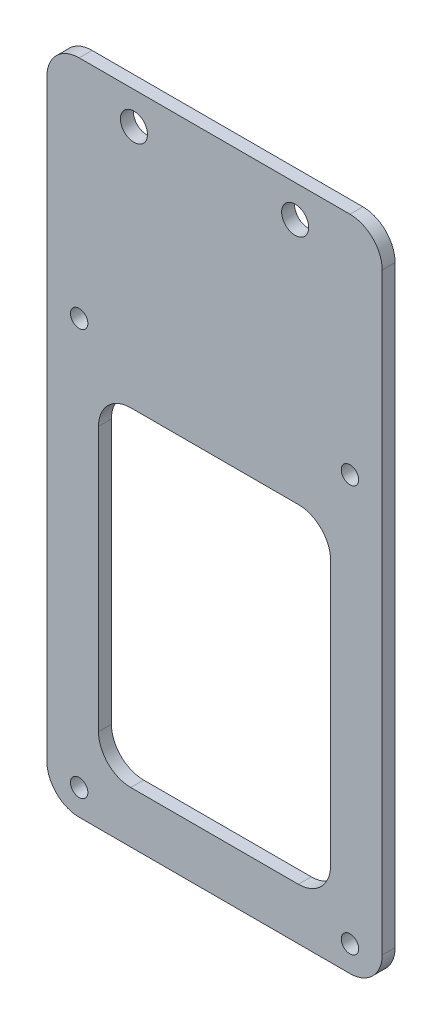
ISO-10303-21;
HEADER;
FILE_DESCRIPTION(('STEP AP214'),'2;1');
FILE_NAME('part.step','',(''),(''),'','','');
FILE_SCHEMA(('AUTOMOTIVE_DESIGN { 1 0 10303 214 1 1 1 1 }'));
ENDSEC;
DATA;
#1=APPLICATION_CONTEXT('core data for automotive mechanical design processes');
#2=APPLICATION_PROTOCOL_DEFINITION('international standard','automotive_design',2000,#1);
#3=PRODUCT_CONTEXT('',#1,'mechanical');
#4=PRODUCT('Part','Part','',(#3));
#5=PRODUCT_RELATED_PRODUCT_CATEGORY('part','',(#4));
#6=PRODUCT_DEFINITION_FORMATION('','',#4);
#7=PRODUCT_DEFINITION_CONTEXT('part definition',#1,'design');
#8=PRODUCT_DEFINITION('design','',#6,#7);
#9=PRODUCT_DEFINITION_SHAPE('','',#8);
#10=(LENGTH_UNIT() NAMED_UNIT(*) SI_UNIT(.MILLI.,.METRE.));
#11=(NAMED_UNIT(*) PLANE_ANGLE_UNIT() SI_UNIT($,.RADIAN.));
#12=(NAMED_UNIT(*) SI_UNIT($,.STERADIAN.) SOLID_ANGLE_UNIT());
#13=UNCERTAINTY_MEASURE_WITH_UNIT(LENGTH_MEASURE(1.E-05),#10,'distance_accuracy_value','');
#14=(GEOMETRIC_REPRESENTATION_CONTEXT(3) GLOBAL_UNCERTAINTY_ASSIGNED_CONTEXT((#13)) GLOBAL_UNIT_ASSIGNED_CONTEXT((#10,
#11,#12)) REPRESENTATION_CONTEXT('',''));
#15=CARTESIAN_POINT('',(0.,0.,0.));
#16=DIRECTION('',(0.,0.,1.));
#17=DIRECTION('',(1.,0.,0.));
#18=AXIS2_PLACEMENT_3D('',#15,#16,#17);
#19=CARTESIAN_POINT('',(26.,-51.,2.));
#20=DIRECTION('',(-1.,0.,0.));
#21=DIRECTION('',(0.,0.,1.));
#22=AXIS2_PLACEMENT_3D('',#19,#20,#21);
#23=PLANE('',#22);
#24=DIRECTION('',(0.,1.,0.));
#25=VECTOR('',#24,1.);
#26=CARTESIAN_POINT('',(26.,-51.,2.));
#27=LINE('',#26,#25);
#28=CARTESIAN_POINT('',(26.,-46.,2.));
#29=VERTEX_POINT('',#28);
#30=CARTESIAN_POINT('',(26.,46.,2.));
#31=VERTEX_POINT('',#30);
#32=EDGE_CURVE('E173',#29,#31,#27,.T.);
#33=ORIENTED_EDGE('',*,*,#32,.F.);
#34=DIRECTION('',(0.,0.,-1.));
#35=VECTOR('',#34,1.);
#36=CARTESIAN_POINT('',(26.,-46.,2.));
#37=LINE('',#36,#35);
#38=CARTESIAN_POINT('',(26.,-46.,0.));
#39=VERTEX_POINT('',#38);
#40=EDGE_CURVE('E201',#29,#39,#37,.T.);
#41=ORIENTED_EDGE('',*,*,#40,.T.);
#42=DIRECTION('',(0.,1.,0.));
#43=VECTOR('',#42,1.);
#44=CARTESIAN_POINT('',(26.,-51.,0.));
#45=LINE('',#44,#43);
#46=CARTESIAN_POINT('',(26.,46.,0.));
#47=VERTEX_POINT('',#46);
#48=EDGE_CURVE('E330',#39,#47,#45,.T.);
#49=ORIENTED_EDGE('',*,*,#48,.T.);
#50=DIRECTION('',(0.,0.,-1.));
#51=VECTOR('',#50,1.);
#52=CARTESIAN_POINT('',(26.,46.,2.));
#53=LINE('',#52,#51);
#54=EDGE_CURVE('E199',#47,#31,#53,.F.);
#55=ORIENTED_EDGE('',*,*,#54,.T.);
#56=EDGE_LOOP('',(#33,#41,#49,#55));
#57=FACE_BOUND('',#56,.T.);
#58=ADVANCED_FACE('F34',(#57),#23,.F.);
#59=CARTESIAN_POINT('',(-26.,51.,2.));
#60=DIRECTION('',(0.,-1.,0.));
#61=DIRECTION('',(0.,0.,-1.));
#62=AXIS2_PLACEMENT_3D('',#59,#60,#61);
#63=PLANE('',#62);
#64=DIRECTION('',(-1.,0.,0.));
#65=VECTOR('',#64,1.);
#66=CARTESIAN_POINT('',(-26.,51.,0.));
#67=LINE('',#66,#65);
#68=CARTESIAN_POINT('',(21.,51.,0.));
#69=VERTEX_POINT('',#68);
#70=CARTESIAN_POINT('',(-21.,51.,0.));
#71=VERTEX_POINT('',#70);
#72=EDGE_CURVE('E179',#69,#71,#67,.T.);
#73=ORIENTED_EDGE('',*,*,#72,.T.);
#74=DIRECTION('',(0.,0.,-1.));
#75=VECTOR('',#74,1.);
#76=CARTESIAN_POINT('',(-21.,51.,2.));
#77=LINE('',#76,#75);
#78=CARTESIAN_POINT('',(-21.,51.,2.));
#79=VERTEX_POINT('',#78);
#80=EDGE_CURVE('E207',#71,#79,#77,.F.);
#81=ORIENTED_EDGE('',*,*,#80,.T.);
#82=DIRECTION('',(-1.,0.,0.));
#83=VECTOR('',#82,1.);
#84=CARTESIAN_POINT('',(-26.,51.,2.));
#85=LINE('',#84,#83);
#86=CARTESIAN_POINT('',(21.,51.,2.));
#87=VERTEX_POINT('',#86);
#88=EDGE_CURVE('E177',#87,#79,#85,.T.);
#89=ORIENTED_EDGE('',*,*,#88,.F.);
#90=DIRECTION('',(0.,0.,-1.));
#91=VECTOR('',#90,1.);
#92=CARTESIAN_POINT('',(21.,51.,2.));
#93=LINE('',#92,#91);
#94=EDGE_CURVE('E204',#87,#69,#93,.T.);
#95=ORIENTED_EDGE('',*,*,#94,.T.);
#96=EDGE_LOOP('',(#73,#81,#89,#95));
#97=FACE_BOUND('',#96,.T.);
#98=ADVANCED_FACE('F344',(#97),#63,.F.);
#99=CARTESIAN_POINT('',(-26.,-51.,2.));
#100=DIRECTION('',(1.,0.,0.));
#101=DIRECTION('',(0.,0.,-1.));
#102=AXIS2_PLACEMENT_3D('',#99,#100,#101);
#103=PLANE('',#102);
#104=DIRECTION('',(0.,-1.,0.));
#105=VECTOR('',#104,1.);
#106=CARTESIAN_POINT('',(-26.,-51.,0.));
#107=LINE('',#106,#105);
#108=CARTESIAN_POINT('',(-26.,46.,0.));
#109=VERTEX_POINT('',#108);
#110=CARTESIAN_POINT('',(-26.,-46.,0.));
#111=VERTEX_POINT('',#110);
#112=EDGE_CURVE('E174',#109,#111,#107,.T.);
#113=ORIENTED_EDGE('',*,*,#112,.T.);
#114=DIRECTION('',(0.,0.,-1.));
#115=VECTOR('',#114,1.);
#116=CARTESIAN_POINT('',(-26.,-46.,2.));
#117=LINE('',#116,#115);
#118=CARTESIAN_POINT('',(-26.,-46.,2.));
#119=VERTEX_POINT('',#118);
#120=EDGE_CURVE('E152',#111,#119,#117,.F.);
#121=ORIENTED_EDGE('',*,*,#120,.T.);
#122=DIRECTION('',(0.,-1.,0.));
#123=VECTOR('',#122,1.);
#124=CARTESIAN_POINT('',(-26.,-51.,2.));
#125=LINE('',#124,#123);
#126=CARTESIAN_POINT('',(-26.,46.,2.));
#127=VERTEX_POINT('',#126);
#128=EDGE_CURVE('E335',#127,#119,#125,.T.);
#129=ORIENTED_EDGE('',*,*,#128,.F.);
#130=DIRECTION('',(0.,0.,-1.));
#131=VECTOR('',#130,1.);
#132=CARTESIAN_POINT('',(-26.,46.,2.));
#133=LINE('',#132,#131);
#134=EDGE_CURVE('E157',#127,#109,#133,.T.);
#135=ORIENTED_EDGE('',*,*,#134,.T.);
#136=EDGE_LOOP('',(#113,#121,#129,#135));
#137=FACE_BOUND('',#136,.T.);
#138=ADVANCED_FACE('F354',(#137),#103,.F.);
#139=CARTESIAN_POINT('',(-26.,-51.,2.));
#140=DIRECTION('',(0.,1.,0.));
#141=DIRECTION('',(0.,0.,1.));
#142=AXIS2_PLACEMENT_3D('',#139,#140,#141);
#143=PLANE('',#142);
#144=DIRECTION('',(1.,0.,0.));
#145=VECTOR('',#144,1.);
#146=CARTESIAN_POINT('',(-26.,-51.,2.));
#147=LINE('',#146,#145);
#148=CARTESIAN_POINT('',(-21.,-51.,2.));
#149=VERTEX_POINT('',#148);
#150=CARTESIAN_POINT('',(21.,-51.,2.));
#151=VERTEX_POINT('',#150);
#152=EDGE_CURVE('E167',#149,#151,#147,.T.);
#153=ORIENTED_EDGE('',*,*,#152,.F.);
#154=DIRECTION('',(0.,0.,-1.));
#155=VECTOR('',#154,1.);
#156=CARTESIAN_POINT('',(-21.,-51.,2.));
#157=LINE('',#156,#155);
#158=CARTESIAN_POINT('',(-21.,-51.,0.));
#159=VERTEX_POINT('',#158);
#160=EDGE_CURVE('E151',#149,#159,#157,.T.);
#161=ORIENTED_EDGE('',*,*,#160,.T.);
#162=DIRECTION('',(1.,0.,0.));
#163=VECTOR('',#162,1.);
#164=CARTESIAN_POINT('',(-26.,-51.,0.));
#165=LINE('',#164,#163);
#166=CARTESIAN_POINT('',(21.,-51.,0.));
#167=VERTEX_POINT('',#166);
#168=EDGE_CURVE('E164',#159,#167,#165,.T.);
#169=ORIENTED_EDGE('',*,*,#168,.T.);
#170=DIRECTION('',(0.,0.,-1.));
#171=VECTOR('',#170,1.);
#172=CARTESIAN_POINT('',(21.,-51.,2.));
#173=LINE('',#172,#171);
#174=EDGE_CURVE('E169',#167,#151,#173,.F.);
#175=ORIENTED_EDGE('',*,*,#174,.T.);
#176=EDGE_LOOP('',(#153,#161,#169,#175));
#177=FACE_BOUND('',#176,.T.);
#178=ADVANCED_FACE('F163',(#177),#143,.F.);
#179=CARTESIAN_POINT('',(0.,0.,2.));
#180=DIRECTION('',(0.,0.,-1.));
#181=DIRECTION('',(-1.,0.,0.));
#182=AXIS2_PLACEMENT_3D('',#179,#180,#181);
#183=PLANE('',#182);
#184=DIRECTION('',(-1.,0.,0.));
#185=VECTOR('',#184,1.);
#186=CARTESIAN_POINT('',(-18.,8.,2.));
#187=LINE('',#186,#185);
#188=CARTESIAN_POINT('',(13.,8.,2.));
#189=VERTEX_POINT('',#188);
#190=CARTESIAN_POINT('',(-13.,8.,2.));
#191=VERTEX_POINT('',#190);
#192=EDGE_CURVE('E255',#189,#191,#187,.T.);
#193=ORIENTED_EDGE('',*,*,#192,.F.);
#194=CARTESIAN_POINT('',(13.,3.,2.));
#195=DIRECTION('',(0.,0.,-1.));
#196=DIRECTION('',(-1.,0.,0.));
#197=AXIS2_PLACEMENT_3D('',#194,#195,#196);
#198=CIRCLE('',#197,5.);
#199=CARTESIAN_POINT('',(18.,3.,2.));
#200=VERTEX_POINT('',#199);
#201=EDGE_CURVE('E42',#189,#200,#198,.T.);
#202=ORIENTED_EDGE('',*,*,#201,.T.);
#203=DIRECTION('',(0.,1.,0.));
#204=VECTOR('',#203,1.);
#205=CARTESIAN_POINT('',(18.,8.,2.));
#206=LINE('',#205,#204);
#207=CARTESIAN_POINT('',(18.,-38.,2.));
#208=VERTEX_POINT('',#207);
#209=EDGE_CURVE('E254',#208,#200,#206,.T.);
#210=ORIENTED_EDGE('',*,*,#209,.F.);
#211=CARTESIAN_POINT('',(13.,-38.,2.));
#212=DIRECTION('',(0.,0.,-1.));
#213=DIRECTION('',(-1.,0.,0.));
#214=AXIS2_PLACEMENT_3D('',#211,#212,#213);
#215=CIRCLE('',#214,5.);
#216=CARTESIAN_POINT('',(13.,-43.,2.));
#217=VERTEX_POINT('',#216);
#218=EDGE_CURVE('E240',#208,#217,#215,.T.);
#219=ORIENTED_EDGE('',*,*,#218,.T.);
#220=DIRECTION('',(1.,0.,0.));
#221=VECTOR('',#220,1.);
#222=CARTESIAN_POINT('',(-18.,-43.,2.));
#223=LINE('',#222,#221);
#224=CARTESIAN_POINT('',(-13.,-43.,2.));
#225=VERTEX_POINT('',#224);
#226=EDGE_CURVE('E289',#225,#217,#223,.T.);
#227=ORIENTED_EDGE('',*,*,#226,.F.);
#228=CARTESIAN_POINT('',(-13.,-38.,2.));
#229=DIRECTION('',(0.,0.,-1.));
#230=DIRECTION('',(-1.,0.,0.));
#231=AXIS2_PLACEMENT_3D('',#228,#229,#230);
#232=CIRCLE('',#231,5.);
#233=CARTESIAN_POINT('',(-18.,-38.,2.));
#234=VERTEX_POINT('',#233);
#235=EDGE_CURVE('E244',#225,#234,#232,.T.);
#236=ORIENTED_EDGE('',*,*,#235,.T.);
#237=DIRECTION('',(0.,-1.,0.));
#238=VECTOR('',#237,1.);
#239=CARTESIAN_POINT('',(-18.,8.,2.));
#240=LINE('',#239,#238);
#241=CARTESIAN_POINT('',(-18.,3.,2.));
#242=VERTEX_POINT('',#241);
#243=EDGE_CURVE('E278',#242,#234,#240,.T.);
#244=ORIENTED_EDGE('',*,*,#243,.F.);
#245=CARTESIAN_POINT('',(-13.,3.,2.));
#246=DIRECTION('',(0.,0.,-1.));
#247=DIRECTION('',(-1.,0.,0.));
#248=AXIS2_PLACEMENT_3D('',#245,#246,#247);
#249=CIRCLE('',#248,5.);
#250=EDGE_CURVE('E49',#242,#191,#249,.T.);
#251=ORIENTED_EDGE('',*,*,#250,.T.);
#252=EDGE_LOOP('',(#193,#202,#210,#219,#227,#236,#244,#251));
#253=FACE_BOUND('',#252,.T.);
#254=CARTESIAN_POINT('',(-21.,-47.,2.));
#255=DIRECTION('',(0.,0.,1.));
#256=DIRECTION('',(1.,0.,0.));
#257=AXIS2_PLACEMENT_3D('',#254,#255,#256);
#258=CIRCLE('',#257,1.35);
#259=CARTESIAN_POINT('',(-19.65,-47.,2.));
#260=VERTEX_POINT('',#259);
#261=EDGE_CURVE('E301',#260,#260,#258,.T.);
#262=ORIENTED_EDGE('',*,*,#261,.F.);
#263=EDGE_LOOP('',(#262));
#264=FACE_BOUND('',#263,.T.);
#265=CARTESIAN_POINT('',(21.,16.,2.));
#266=DIRECTION('',(0.,0.,1.));
#267=DIRECTION('',(-1.,0.,0.));
#268=AXIS2_PLACEMENT_3D('',#265,#266,#267);
#269=CIRCLE('',#268,1.35);
#270=CARTESIAN_POINT('',(19.65,16.,2.));
#271=VERTEX_POINT('',#270);
#272=EDGE_CURVE('E307',#271,#271,#269,.T.);
#273=ORIENTED_EDGE('',*,*,#272,.F.);
#274=EDGE_LOOP('',(#273));
#275=FACE_BOUND('',#274,.T.);
#276=CARTESIAN_POINT('',(-21.,16.,2.));
#277=DIRECTION('',(0.,0.,1.));
#278=DIRECTION('',(1.,0.,0.));
#279=AXIS2_PLACEMENT_3D('',#276,#277,#278);
#280=CIRCLE('',#279,1.35);
#281=CARTESIAN_POINT('',(-19.65,16.,2.));
#282=VERTEX_POINT('',#281);
#283=EDGE_CURVE('E306',#282,#282,#280,.T.);
#284=ORIENTED_EDGE('',*,*,#283,.F.);
#285=EDGE_LOOP('',(#284));
#286=FACE_BOUND('',#285,.T.);
#287=CARTESIAN_POINT('',(12.5,46.,2.));
#288=DIRECTION('',(0.,0.,1.));
#289=DIRECTION('',(-1.,0.,0.));
#290=AXIS2_PLACEMENT_3D('',#287,#288,#289);
#291=CIRCLE('',#290,2.1);
#292=CARTESIAN_POINT('',(10.4,46.,2.));
#293=VERTEX_POINT('',#292);
#294=EDGE_CURVE('E319',#293,#293,#291,.T.);
#295=ORIENTED_EDGE('',*,*,#294,.F.);
#296=EDGE_LOOP('',(#295));
#297=FACE_BOUND('',#296,.T.);
#298=CARTESIAN_POINT('',(21.,-47.,2.));
#299=DIRECTION('',(0.,0.,1.));
#300=DIRECTION('',(-1.,0.,0.));
#301=AXIS2_PLACEMENT_3D('',#298,#299,#300);
#302=CIRCLE('',#301,1.35);
#303=CARTESIAN_POINT('',(19.65,-47.,2.));
#304=VERTEX_POINT('',#303);
#305=EDGE_CURVE('E292',#304,#304,#302,.T.);
#306=ORIENTED_EDGE('',*,*,#305,.F.);
#307=EDGE_LOOP('',(#306));
#308=FACE_BOUND('',#307,.T.);
#309=CARTESIAN_POINT('',(-12.5,46.,2.));
#310=DIRECTION('',(0.,0.,1.));
#311=DIRECTION('',(1.,0.,0.));
#312=AXIS2_PLACEMENT_3D('',#309,#310,#311);
#313=CIRCLE('',#312,2.1);
#314=CARTESIAN_POINT('',(-10.4,46.,2.));
#315=VERTEX_POINT('',#314);
#316=EDGE_CURVE('E318',#315,#315,#313,.T.);
#317=ORIENTED_EDGE('',*,*,#316,.F.);
#318=EDGE_LOOP('',(#317));
#319=FACE_BOUND('',#318,.T.);
#320=ORIENTED_EDGE('',*,*,#128,.T.);
#321=CARTESIAN_POINT('',(-21.,-46.,2.));
#322=DIRECTION('',(0.,0.,-1.));
#323=DIRECTION('',(-1.,0.,0.));
#324=AXIS2_PLACEMENT_3D('',#321,#322,#323);
#325=CIRCLE('',#324,5.);
#326=EDGE_CURVE('E197',#119,#149,#325,.F.);
#327=ORIENTED_EDGE('',*,*,#326,.T.);
#328=ORIENTED_EDGE('',*,*,#152,.T.);
#329=CARTESIAN_POINT('',(21.,-46.,2.));
#330=DIRECTION('',(0.,0.,-1.));
#331=DIRECTION('',(-1.,0.,0.));
#332=AXIS2_PLACEMENT_3D('',#329,#330,#331);
#333=CIRCLE('',#332,5.);
#334=EDGE_CURVE('E195',#151,#29,#333,.F.);
#335=ORIENTED_EDGE('',*,*,#334,.T.);
#336=ORIENTED_EDGE('',*,*,#32,.T.);
#337=CARTESIAN_POINT('',(21.,46.,2.));
#338=DIRECTION('',(0.,0.,-1.));
#339=DIRECTION('',(-1.,0.,0.));
#340=AXIS2_PLACEMENT_3D('',#337,#338,#339);
#341=CIRCLE('',#340,5.);
#342=EDGE_CURVE('E191',#31,#87,#341,.F.);
#343=ORIENTED_EDGE('',*,*,#342,.T.);
#344=ORIENTED_EDGE('',*,*,#88,.T.);
#345=CARTESIAN_POINT('',(-21.,46.,2.));
#346=DIRECTION('',(0.,0.,-1.));
#347=DIRECTION('',(-1.,0.,0.));
#348=AXIS2_PLACEMENT_3D('',#345,#346,#347);
#349=CIRCLE('',#348,5.);
#350=EDGE_CURVE('E193',#79,#127,#349,.F.);
#351=ORIENTED_EDGE('',*,*,#350,.T.);
#352=EDGE_LOOP('',(#320,#327,#328,#335,#336,#343,#344,#351));
#353=FACE_BOUND('',#352,.T.);
#354=ADVANCED_FACE('F252',(#253,#264,#275,#286,#297,#308,#319,#353),#183,.F.);
#355=CARTESIAN_POINT('',(0.,0.,0.));
#356=DIRECTION('',(0.,0.,-1.));
#357=DIRECTION('',(-1.,0.,0.));
#358=AXIS2_PLACEMENT_3D('',#355,#356,#357);
#359=PLANE('',#358);
#360=DIRECTION('',(0.,-1.,0.));
#361=VECTOR('',#360,1.);
#362=CARTESIAN_POINT('',(18.,0.,0.));
#363=LINE('',#362,#361);
#364=CARTESIAN_POINT('',(18.,3.,0.));
#365=VERTEX_POINT('',#364);
#366=CARTESIAN_POINT('',(18.,-38.,0.));
#367=VERTEX_POINT('',#366);
#368=EDGE_CURVE('E218',#365,#367,#363,.T.);
#369=ORIENTED_EDGE('',*,*,#368,.F.);
#370=CARTESIAN_POINT('',(13.,3.,0.));
#371=DIRECTION('',(0.,0.,-1.));
#372=DIRECTION('',(-1.,0.,0.));
#373=AXIS2_PLACEMENT_3D('',#370,#371,#372);
#374=CIRCLE('',#373,5.);
#375=CARTESIAN_POINT('',(13.,8.,0.));
#376=VERTEX_POINT('',#375);
#377=EDGE_CURVE('E11',#365,#376,#374,.F.);
#378=ORIENTED_EDGE('',*,*,#377,.T.);
#379=DIRECTION('',(1.,0.,0.));
#380=VECTOR('',#379,1.);
#381=CARTESIAN_POINT('',(0.,8.,0.));
#382=LINE('',#381,#380);
#383=CARTESIAN_POINT('',(-13.,8.,0.));
#384=VERTEX_POINT('',#383);
#385=EDGE_CURVE('E209',#384,#376,#382,.T.);
#386=ORIENTED_EDGE('',*,*,#385,.F.);
#387=CARTESIAN_POINT('',(-13.,3.,0.));
#388=DIRECTION('',(0.,0.,-1.));
#389=DIRECTION('',(-1.,0.,0.));
#390=AXIS2_PLACEMENT_3D('',#387,#388,#389);
#391=CIRCLE('',#390,5.);
#392=CARTESIAN_POINT('',(-18.,3.,0.));
#393=VERTEX_POINT('',#392);
#394=EDGE_CURVE('E249',#384,#393,#391,.F.);
#395=ORIENTED_EDGE('',*,*,#394,.T.);
#396=DIRECTION('',(0.,1.,0.));
#397=VECTOR('',#396,1.);
#398=CARTESIAN_POINT('',(-18.,0.,0.));
#399=LINE('',#398,#397);
#400=CARTESIAN_POINT('',(-18.,-38.,0.));
#401=VERTEX_POINT('',#400);
#402=EDGE_CURVE('E212',#401,#393,#399,.T.);
#403=ORIENTED_EDGE('',*,*,#402,.F.);
#404=CARTESIAN_POINT('',(-13.,-38.,0.));
#405=DIRECTION('',(0.,0.,-1.));
#406=DIRECTION('',(-1.,0.,0.));
#407=AXIS2_PLACEMENT_3D('',#404,#405,#406);
#408=CIRCLE('',#407,5.);
#409=CARTESIAN_POINT('',(-13.,-43.,0.));
#410=VERTEX_POINT('',#409);
#411=EDGE_CURVE('E246',#401,#410,#408,.F.);
#412=ORIENTED_EDGE('',*,*,#411,.T.);
#413=DIRECTION('',(-1.,0.,0.));
#414=VECTOR('',#413,1.);
#415=CARTESIAN_POINT('',(0.,-43.,0.));
#416=LINE('',#415,#414);
#417=CARTESIAN_POINT('',(13.,-43.,0.));
#418=VERTEX_POINT('',#417);
#419=EDGE_CURVE('E215',#418,#410,#416,.T.);
#420=ORIENTED_EDGE('',*,*,#419,.F.);
#421=CARTESIAN_POINT('',(13.,-38.,0.));
#422=DIRECTION('',(0.,0.,-1.));
#423=DIRECTION('',(-1.,0.,0.));
#424=AXIS2_PLACEMENT_3D('',#421,#422,#423);
#425=CIRCLE('',#424,5.);
#426=EDGE_CURVE('E242',#418,#367,#425,.F.);
#427=ORIENTED_EDGE('',*,*,#426,.T.);
#428=EDGE_LOOP('',(#369,#378,#386,#395,#403,#412,#420,#427));
#429=FACE_BOUND('',#428,.T.);
#430=CARTESIAN_POINT('',(-21.,-47.,0.));
#431=DIRECTION('',(0.,0.,1.));
#432=DIRECTION('',(1.,0.,0.));
#433=AXIS2_PLACEMENT_3D('',#430,#431,#432);
#434=CIRCLE('',#433,1.35);
#435=CARTESIAN_POINT('',(-19.65,-47.,0.));
#436=VERTEX_POINT('',#435);
#437=EDGE_CURVE('E310',#436,#436,#434,.T.);
#438=ORIENTED_EDGE('',*,*,#437,.T.);
#439=EDGE_LOOP('',(#438));
#440=FACE_BOUND('',#439,.T.);
#441=CARTESIAN_POINT('',(21.,16.,0.));
#442=DIRECTION('',(0.,0.,1.));
#443=DIRECTION('',(-1.,0.,0.));
#444=AXIS2_PLACEMENT_3D('',#441,#442,#443);
#445=CIRCLE('',#444,1.35);
#446=CARTESIAN_POINT('',(19.65,16.,0.));
#447=VERTEX_POINT('',#446);
#448=EDGE_CURVE('E303',#447,#447,#445,.T.);
#449=ORIENTED_EDGE('',*,*,#448,.T.);
#450=EDGE_LOOP('',(#449));
#451=FACE_BOUND('',#450,.T.);
#452=CARTESIAN_POINT('',(-21.,16.,0.));
#453=DIRECTION('',(0.,0.,1.));
#454=DIRECTION('',(1.,0.,0.));
#455=AXIS2_PLACEMENT_3D('',#452,#453,#454);
#456=CIRCLE('',#455,1.35);
#457=CARTESIAN_POINT('',(-19.65,16.,0.));
#458=VERTEX_POINT('',#457);
#459=EDGE_CURVE('E322',#458,#458,#456,.T.);
#460=ORIENTED_EDGE('',*,*,#459,.T.);
#461=EDGE_LOOP('',(#460));
#462=FACE_BOUND('',#461,.T.);
#463=CARTESIAN_POINT('',(12.5,46.,0.));
#464=DIRECTION('',(0.,0.,1.));
#465=DIRECTION('',(-1.,0.,0.));
#466=AXIS2_PLACEMENT_3D('',#463,#464,#465);
#467=CIRCLE('',#466,2.1);
#468=CARTESIAN_POINT('',(10.4,46.,0.));
#469=VERTEX_POINT('',#468);
#470=EDGE_CURVE('E315',#469,#469,#467,.T.);
#471=ORIENTED_EDGE('',*,*,#470,.T.);
#472=EDGE_LOOP('',(#471));
#473=FACE_BOUND('',#472,.T.);
#474=CARTESIAN_POINT('',(21.,-47.,0.));
#475=DIRECTION('',(0.,0.,1.));
#476=DIRECTION('',(-1.,0.,0.));
#477=AXIS2_PLACEMENT_3D('',#474,#475,#476);
#478=CIRCLE('',#477,1.35);
#479=CARTESIAN_POINT('',(19.65,-47.,0.));
#480=VERTEX_POINT('',#479);
#481=EDGE_CURVE('E295',#480,#480,#478,.T.);
#482=ORIENTED_EDGE('',*,*,#481,.T.);
#483=EDGE_LOOP('',(#482));
#484=FACE_BOUND('',#483,.T.);
#485=CARTESIAN_POINT('',(-12.5,46.,0.));
#486=DIRECTION('',(0.,0.,1.));
#487=DIRECTION('',(1.,0.,0.));
#488=AXIS2_PLACEMENT_3D('',#485,#486,#487);
#489=CIRCLE('',#488,2.1);
#490=CARTESIAN_POINT('',(-10.4,46.,0.));
#491=VERTEX_POINT('',#490);
#492=EDGE_CURVE('E327',#491,#491,#489,.T.);
#493=ORIENTED_EDGE('',*,*,#492,.T.);
#494=EDGE_LOOP('',(#493));
#495=FACE_BOUND('',#494,.T.);
#496=ORIENTED_EDGE('',*,*,#168,.F.);
#497=CARTESIAN_POINT('',(-21.,-46.,0.));
#498=DIRECTION('',(0.,0.,-1.));
#499=DIRECTION('',(-1.,0.,0.));
#500=AXIS2_PLACEMENT_3D('',#497,#498,#499);
#501=CIRCLE('',#500,5.);
#502=EDGE_CURVE('E147',#159,#111,#501,.T.);
#503=ORIENTED_EDGE('',*,*,#502,.T.);
#504=ORIENTED_EDGE('',*,*,#112,.F.);
#505=CARTESIAN_POINT('',(-21.,46.,0.));
#506=DIRECTION('',(0.,0.,-1.));
#507=DIRECTION('',(-1.,0.,0.));
#508=AXIS2_PLACEMENT_3D('',#505,#506,#507);
#509=CIRCLE('',#508,5.);
#510=EDGE_CURVE('E185',#109,#71,#509,.T.);
#511=ORIENTED_EDGE('',*,*,#510,.T.);
#512=ORIENTED_EDGE('',*,*,#72,.F.);
#513=CARTESIAN_POINT('',(21.,46.,0.));
#514=DIRECTION('',(0.,0.,-1.));
#515=DIRECTION('',(-1.,0.,0.));
#516=AXIS2_PLACEMENT_3D('',#513,#514,#515);
#517=CIRCLE('',#516,5.);
#518=EDGE_CURVE('E168',#69,#47,#517,.T.);
#519=ORIENTED_EDGE('',*,*,#518,.T.);
#520=ORIENTED_EDGE('',*,*,#48,.F.);
#521=CARTESIAN_POINT('',(21.,-46.,0.));
#522=DIRECTION('',(0.,0.,-1.));
#523=DIRECTION('',(-1.,0.,0.));
#524=AXIS2_PLACEMENT_3D('',#521,#522,#523);
#525=CIRCLE('',#524,5.);
#526=EDGE_CURVE('E158',#39,#167,#525,.T.);
#527=ORIENTED_EDGE('',*,*,#526,.T.);
#528=EDGE_LOOP('',(#496,#503,#504,#511,#512,#519,#520,#527));
#529=FACE_BOUND('',#528,.T.);
#530=ADVANCED_FACE('F171',(#429,#440,#451,#462,#473,#484,#495,#529),#359,.T.);
#531=CARTESIAN_POINT('',(-21.,-46.,2.));
#532=DIRECTION('',(0.,0.,-1.));
#533=DIRECTION('',(-1.,0.,0.));
#534=AXIS2_PLACEMENT_3D('',#531,#532,#533);
#535=CYLINDRICAL_SURFACE('',#534,5.);
#536=ORIENTED_EDGE('',*,*,#326,.F.);
#537=ORIENTED_EDGE('',*,*,#120,.F.);
#538=ORIENTED_EDGE('',*,*,#502,.F.);
#539=ORIENTED_EDGE('',*,*,#160,.F.);
#540=EDGE_LOOP('',(#536,#537,#538,#539));
#541=FACE_BOUND('',#540,.T.);
#542=ADVANCED_FACE('F150',(#541),#535,.T.);
#543=CARTESIAN_POINT('',(21.,-46.,2.));
#544=DIRECTION('',(0.,0.,-1.));
#545=DIRECTION('',(-1.,0.,0.));
#546=AXIS2_PLACEMENT_3D('',#543,#544,#545);
#547=CYLINDRICAL_SURFACE('',#546,5.);
#548=ORIENTED_EDGE('',*,*,#334,.F.);
#549=ORIENTED_EDGE('',*,*,#174,.F.);
#550=ORIENTED_EDGE('',*,*,#526,.F.);
#551=ORIENTED_EDGE('',*,*,#40,.F.);
#552=EDGE_LOOP('',(#548,#549,#550,#551));
#553=FACE_BOUND('',#552,.T.);
#554=ADVANCED_FACE('F372',(#553),#547,.T.);
#555=CARTESIAN_POINT('',(-21.,46.,2.));
#556=DIRECTION('',(0.,0.,-1.));
#557=DIRECTION('',(-1.,0.,0.));
#558=AXIS2_PLACEMENT_3D('',#555,#556,#557);
#559=CYLINDRICAL_SURFACE('',#558,5.);
#560=ORIENTED_EDGE('',*,*,#350,.F.);
#561=ORIENTED_EDGE('',*,*,#80,.F.);
#562=ORIENTED_EDGE('',*,*,#510,.F.);
#563=ORIENTED_EDGE('',*,*,#134,.F.);
#564=EDGE_LOOP('',(#560,#561,#562,#563));
#565=FACE_BOUND('',#564,.T.);
#566=ADVANCED_FACE('F349',(#565),#559,.T.);
#567=CARTESIAN_POINT('',(21.,46.,2.));
#568=DIRECTION('',(0.,0.,-1.));
#569=DIRECTION('',(-1.,0.,0.));
#570=AXIS2_PLACEMENT_3D('',#567,#568,#569);
#571=CYLINDRICAL_SURFACE('',#570,5.);
#572=ORIENTED_EDGE('',*,*,#342,.F.);
#573=ORIENTED_EDGE('',*,*,#54,.F.);
#574=ORIENTED_EDGE('',*,*,#518,.F.);
#575=ORIENTED_EDGE('',*,*,#94,.F.);
#576=EDGE_LOOP('',(#572,#573,#574,#575));
#577=FACE_BOUND('',#576,.T.);
#578=ADVANCED_FACE('F378',(#577),#571,.T.);
#579=CARTESIAN_POINT('',(-12.5,46.,0.));
#580=DIRECTION('',(0.,0.,1.));
#581=DIRECTION('',(1.,0.,0.));
#582=AXIS2_PLACEMENT_3D('',#579,#580,#581);
#583=CYLINDRICAL_SURFACE('',#582,2.1);
#584=ORIENTED_EDGE('',*,*,#492,.F.);
#585=EDGE_LOOP('',(#584));
#586=FACE_BOUND('',#585,.T.);
#587=ORIENTED_EDGE('',*,*,#316,.T.);
#588=EDGE_LOOP('',(#587));
#589=FACE_BOUND('',#588,.T.);
#590=ADVANCED_FACE('F381',(#586,#589),#583,.F.);
#591=CARTESIAN_POINT('',(21.,-47.,0.));
#592=DIRECTION('',(0.,0.,1.));
#593=DIRECTION('',(1.,0.,0.));
#594=AXIS2_PLACEMENT_3D('',#591,#592,#593);
#595=CYLINDRICAL_SURFACE('',#594,1.35);
#596=ORIENTED_EDGE('',*,*,#481,.F.);
#597=EDGE_LOOP('',(#596));
#598=FACE_BOUND('',#597,.T.);
#599=ORIENTED_EDGE('',*,*,#305,.T.);
#600=EDGE_LOOP('',(#599));
#601=FACE_BOUND('',#600,.T.);
#602=ADVANCED_FACE('F498',(#598,#601),#595,.F.);
#603=CARTESIAN_POINT('',(12.5,46.,0.));
#604=DIRECTION('',(0.,0.,1.));
#605=DIRECTION('',(1.,0.,0.));
#606=AXIS2_PLACEMENT_3D('',#603,#604,#605);
#607=CYLINDRICAL_SURFACE('',#606,2.1);
#608=ORIENTED_EDGE('',*,*,#470,.F.);
#609=EDGE_LOOP('',(#608));
#610=FACE_BOUND('',#609,.T.);
#611=ORIENTED_EDGE('',*,*,#294,.T.);
#612=EDGE_LOOP('',(#611));
#613=FACE_BOUND('',#612,.T.);
#614=ADVANCED_FACE('F488',(#610,#613),#607,.F.);
#615=CARTESIAN_POINT('',(-21.,16.,0.));
#616=DIRECTION('',(0.,0.,1.));
#617=DIRECTION('',(1.,0.,0.));
#618=AXIS2_PLACEMENT_3D('',#615,#616,#617);
#619=CYLINDRICAL_SURFACE('',#618,1.35);
#620=ORIENTED_EDGE('',*,*,#459,.F.);
#621=EDGE_LOOP('',(#620));
#622=FACE_BOUND('',#621,.T.);
#623=ORIENTED_EDGE('',*,*,#283,.T.);
#624=EDGE_LOOP('',(#623));
#625=FACE_BOUND('',#624,.T.);
#626=ADVANCED_FACE('F478',(#622,#625),#619,.F.);
#627=CARTESIAN_POINT('',(21.,16.,0.));
#628=DIRECTION('',(0.,0.,1.));
#629=DIRECTION('',(1.,0.,0.));
#630=AXIS2_PLACEMENT_3D('',#627,#628,#629);
#631=CYLINDRICAL_SURFACE('',#630,1.35);
#632=ORIENTED_EDGE('',*,*,#448,.F.);
#633=EDGE_LOOP('',(#632));
#634=FACE_BOUND('',#633,.T.);
#635=ORIENTED_EDGE('',*,*,#272,.T.);
#636=EDGE_LOOP('',(#635));
#637=FACE_BOUND('',#636,.T.);
#638=ADVANCED_FACE('F468',(#634,#637),#631,.F.);
#639=CARTESIAN_POINT('',(-21.,-47.,0.));
#640=DIRECTION('',(0.,0.,1.));
#641=DIRECTION('',(1.,0.,0.));
#642=AXIS2_PLACEMENT_3D('',#639,#640,#641);
#643=CYLINDRICAL_SURFACE('',#642,1.35);
#644=ORIENTED_EDGE('',*,*,#437,.F.);
#645=EDGE_LOOP('',(#644));
#646=FACE_BOUND('',#645,.T.);
#647=ORIENTED_EDGE('',*,*,#261,.T.);
#648=EDGE_LOOP('',(#647));
#649=FACE_BOUND('',#648,.T.);
#650=ADVANCED_FACE('F441',(#646,#649),#643,.F.);
#651=CARTESIAN_POINT('',(18.,8.,-8.));
#652=DIRECTION('',(1.,0.,0.));
#653=DIRECTION('',(0.,1.,0.));
#654=AXIS2_PLACEMENT_3D('',#651,#652,#653);
#655=PLANE('',#654);
#656=ORIENTED_EDGE('',*,*,#368,.T.);
#657=DIRECTION('',(0.,0.,1.));
#658=VECTOR('',#657,1.);
#659=CARTESIAN_POINT('',(18.,-38.,2.));
#660=LINE('',#659,#658);
#661=EDGE_CURVE('E223',#367,#208,#660,.T.);
#662=ORIENTED_EDGE('',*,*,#661,.T.);
#663=ORIENTED_EDGE('',*,*,#209,.T.);
#664=DIRECTION('',(0.,0.,1.));
#665=VECTOR('',#664,1.);
#666=CARTESIAN_POINT('',(18.,3.,0.));
#667=LINE('',#666,#665);
#668=EDGE_CURVE('E221',#200,#365,#667,.F.);
#669=ORIENTED_EDGE('',*,*,#668,.T.);
#670=EDGE_LOOP('',(#656,#662,#663,#669));
#671=FACE_BOUND('',#670,.T.);
#672=ADVANCED_FACE('F257',(#671),#655,.F.);
#673=CARTESIAN_POINT('',(-18.,-43.,-8.));
#674=DIRECTION('',(0.,-1.,0.));
#675=DIRECTION('',(0.,0.,-1.));
#676=AXIS2_PLACEMENT_3D('',#673,#674,#675);
#677=PLANE('',#676);
#678=ORIENTED_EDGE('',*,*,#226,.T.);
#679=DIRECTION('',(0.,0.,1.));
#680=VECTOR('',#679,1.);
#681=CARTESIAN_POINT('',(13.,-43.,0.));
#682=LINE('',#681,#680);
#683=EDGE_CURVE('E229',#217,#418,#682,.F.);
#684=ORIENTED_EDGE('',*,*,#683,.T.);
#685=ORIENTED_EDGE('',*,*,#419,.T.);
#686=DIRECTION('',(0.,0.,1.));
#687=VECTOR('',#686,1.);
#688=CARTESIAN_POINT('',(-13.,-43.,2.));
#689=LINE('',#688,#687);
#690=EDGE_CURVE('E226',#410,#225,#689,.T.);
#691=ORIENTED_EDGE('',*,*,#690,.T.);
#692=EDGE_LOOP('',(#678,#684,#685,#691));
#693=FACE_BOUND('',#692,.T.);
#694=ADVANCED_FACE('F286',(#693),#677,.F.);
#695=CARTESIAN_POINT('',(-18.,8.,-8.));
#696=DIRECTION('',(-1.,0.,0.));
#697=DIRECTION('',(0.,0.,1.));
#698=AXIS2_PLACEMENT_3D('',#695,#696,#697);
#699=PLANE('',#698);
#700=ORIENTED_EDGE('',*,*,#243,.T.);
#701=DIRECTION('',(0.,0.,1.));
#702=VECTOR('',#701,1.);
#703=CARTESIAN_POINT('',(-18.,-38.,0.));
#704=LINE('',#703,#702);
#705=EDGE_CURVE('E234',#234,#401,#704,.F.);
#706=ORIENTED_EDGE('',*,*,#705,.T.);
#707=ORIENTED_EDGE('',*,*,#402,.T.);
#708=DIRECTION('',(0.,0.,1.));
#709=VECTOR('',#708,1.);
#710=CARTESIAN_POINT('',(-18.,3.,2.));
#711=LINE('',#710,#709);
#712=EDGE_CURVE('E231',#393,#242,#711,.T.);
#713=ORIENTED_EDGE('',*,*,#712,.T.);
#714=EDGE_LOOP('',(#700,#706,#707,#713));
#715=FACE_BOUND('',#714,.T.);
#716=ADVANCED_FACE('F276',(#715),#699,.F.);
#717=CARTESIAN_POINT('',(-18.,8.,-8.));
#718=DIRECTION('',(0.,1.,0.));
#719=DIRECTION('',(0.,0.,1.));
#720=AXIS2_PLACEMENT_3D('',#717,#718,#719);
#721=PLANE('',#720);
#722=ORIENTED_EDGE('',*,*,#192,.T.);
#723=DIRECTION('',(0.,0.,1.));
#724=VECTOR('',#723,1.);
#725=CARTESIAN_POINT('',(-13.,8.,0.));
#726=LINE('',#725,#724);
#727=EDGE_CURVE('E238',#191,#384,#726,.F.);
#728=ORIENTED_EDGE('',*,*,#727,.T.);
#729=ORIENTED_EDGE('',*,*,#385,.T.);
#730=DIRECTION('',(0.,0.,1.));
#731=VECTOR('',#730,1.);
#732=CARTESIAN_POINT('',(13.,8.,2.));
#733=LINE('',#732,#731);
#734=EDGE_CURVE('E236',#376,#189,#733,.T.);
#735=ORIENTED_EDGE('',*,*,#734,.T.);
#736=EDGE_LOOP('',(#722,#728,#729,#735));
#737=FACE_BOUND('',#736,.T.);
#738=ADVANCED_FACE('F267',(#737),#721,.F.);
#739=CARTESIAN_POINT('',(13.,-38.,-8.));
#740=DIRECTION('',(0.,0.,-1.));
#741=DIRECTION('',(-1.,0.,0.));
#742=AXIS2_PLACEMENT_3D('',#739,#740,#741);
#743=CYLINDRICAL_SURFACE('',#742,5.);
#744=ORIENTED_EDGE('',*,*,#426,.F.);
#745=ORIENTED_EDGE('',*,*,#683,.F.);
#746=ORIENTED_EDGE('',*,*,#218,.F.);
#747=ORIENTED_EDGE('',*,*,#661,.F.);
#748=EDGE_LOOP('',(#744,#745,#746,#747));
#749=FACE_BOUND('',#748,.T.);
#750=ADVANCED_FACE('F291',(#749),#743,.F.);
#751=CARTESIAN_POINT('',(-13.,-38.,-8.));
#752=DIRECTION('',(0.,0.,-1.));
#753=DIRECTION('',(-1.,0.,0.));
#754=AXIS2_PLACEMENT_3D('',#751,#752,#753);
#755=CYLINDRICAL_SURFACE('',#754,5.);
#756=ORIENTED_EDGE('',*,*,#411,.F.);
#757=ORIENTED_EDGE('',*,*,#705,.F.);
#758=ORIENTED_EDGE('',*,*,#235,.F.);
#759=ORIENTED_EDGE('',*,*,#690,.F.);
#760=EDGE_LOOP('',(#756,#757,#758,#759));
#761=FACE_BOUND('',#760,.T.);
#762=ADVANCED_FACE('F280',(#761),#755,.F.);
#763=CARTESIAN_POINT('',(-13.,3.,-8.));
#764=DIRECTION('',(0.,0.,-1.));
#765=DIRECTION('',(-1.,0.,0.));
#766=AXIS2_PLACEMENT_3D('',#763,#764,#765);
#767=CYLINDRICAL_SURFACE('',#766,5.);
#768=ORIENTED_EDGE('',*,*,#394,.F.);
#769=ORIENTED_EDGE('',*,*,#727,.F.);
#770=ORIENTED_EDGE('',*,*,#250,.F.);
#771=ORIENTED_EDGE('',*,*,#712,.F.);
#772=EDGE_LOOP('',(#768,#769,#770,#771));
#773=FACE_BOUND('',#772,.T.);
#774=ADVANCED_FACE('F270',(#773),#767,.F.);
#775=CARTESIAN_POINT('',(13.,3.,-8.));
#776=DIRECTION('',(0.,0.,-1.));
#777=DIRECTION('',(-1.,0.,0.));
#778=AXIS2_PLACEMENT_3D('',#775,#776,#777);
#779=CYLINDRICAL_SURFACE('',#778,5.);
#780=ORIENTED_EDGE('',*,*,#377,.F.);
#781=ORIENTED_EDGE('',*,*,#668,.F.);
#782=ORIENTED_EDGE('',*,*,#201,.F.);
#783=ORIENTED_EDGE('',*,*,#734,.F.);
#784=EDGE_LOOP('',(#780,#781,#782,#783));
#785=FACE_BOUND('',#784,.T.);
#786=ADVANCED_FACE('F36',(#785),#779,.F.);
#787=CLOSED_SHELL('',(#58,#98,#138,#178,#354,#530,#542,#554,#566,#578,#590,#602,#614,#626,#638,
#650,#672,#694,#716,#738,#750,#762,#774,#786));
#788=MANIFOLD_SOLID_BREP('B2',#787);
#789=ADVANCED_BREP_SHAPE_REPRESENTATION('',(#18,#788),#14);
#790=SHAPE_DEFINITION_REPRESENTATION(#9,#789);
ENDSEC;
END-ISO-10303-21;
